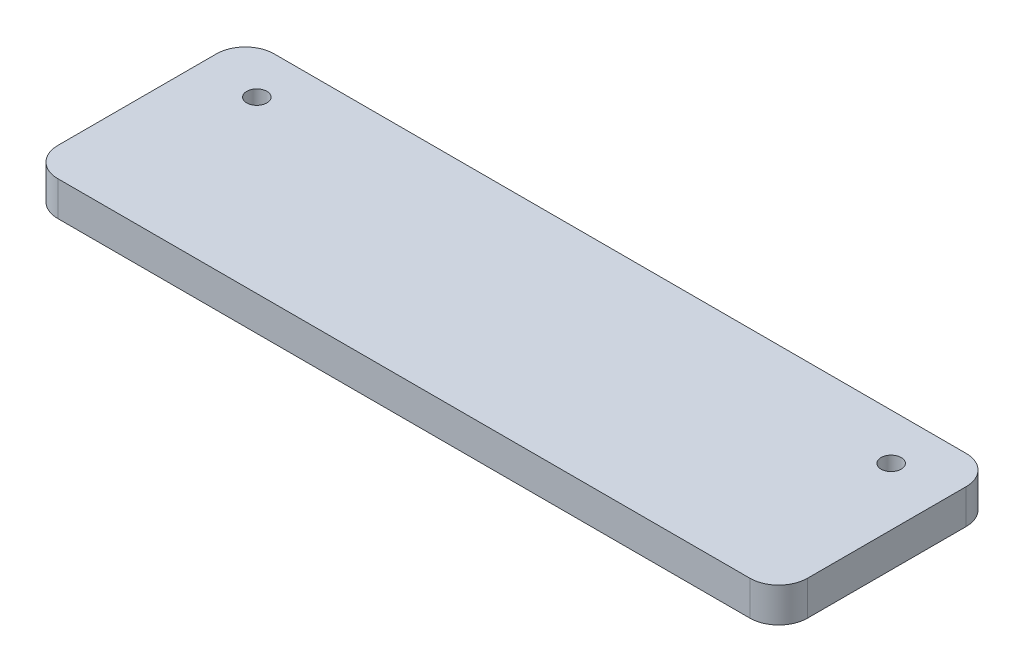
ISO-10303-21;
HEADER;
FILE_DESCRIPTION(('STEP AP214'),'2;1');
FILE_NAME('part.step','',(''),(''),'','','');
FILE_SCHEMA(('AUTOMOTIVE_DESIGN { 1 0 10303 214 1 1 1 1 }'));
ENDSEC;
DATA;
#1=APPLICATION_CONTEXT('core data for automotive mechanical design processes');
#2=APPLICATION_PROTOCOL_DEFINITION('international standard','automotive_design',2000,#1);
#3=PRODUCT_CONTEXT('',#1,'mechanical');
#4=PRODUCT('Part','Part','',(#3));
#5=PRODUCT_RELATED_PRODUCT_CATEGORY('part','',(#4));
#6=PRODUCT_DEFINITION_FORMATION('','',#4);
#7=PRODUCT_DEFINITION_CONTEXT('part definition',#1,'design');
#8=PRODUCT_DEFINITION('design','',#6,#7);
#9=PRODUCT_DEFINITION_SHAPE('','',#8);
#10=(LENGTH_UNIT() NAMED_UNIT(*) SI_UNIT(.MILLI.,.METRE.));
#11=(NAMED_UNIT(*) PLANE_ANGLE_UNIT() SI_UNIT($,.RADIAN.));
#12=(NAMED_UNIT(*) SI_UNIT($,.STERADIAN.) SOLID_ANGLE_UNIT());
#13=UNCERTAINTY_MEASURE_WITH_UNIT(LENGTH_MEASURE(1.E-05),#10,'distance_accuracy_value','');
#14=(GEOMETRIC_REPRESENTATION_CONTEXT(3) GLOBAL_UNCERTAINTY_ASSIGNED_CONTEXT((#13)) GLOBAL_UNIT_ASSIGNED_CONTEXT((#10,
#11,#12)) REPRESENTATION_CONTEXT('',''));
#15=CARTESIAN_POINT('',(0.,0.,0.));
#16=DIRECTION('',(0.,0.,1.));
#17=DIRECTION('',(1.,0.,0.));
#18=AXIS2_PLACEMENT_3D('',#15,#16,#17);
#19=CARTESIAN_POINT('',(0.,6.,0.));
#20=DIRECTION('',(1.,0.,0.));
#21=DIRECTION('',(0.,0.,-1.));
#22=AXIS2_PLACEMENT_3D('',#19,#20,#21);
#23=PLANE('',#22);
#24=DIRECTION('',(0.,0.,1.));
#25=VECTOR('',#24,1.);
#26=CARTESIAN_POINT('',(0.,6.,0.));
#27=LINE('',#26,#25);
#28=CARTESIAN_POINT('',(0.,6.,-32.5));
#29=VERTEX_POINT('',#28);
#30=CARTESIAN_POINT('',(0.,6.,-5.));
#31=VERTEX_POINT('',#30);
#32=EDGE_CURVE('E126',#29,#31,#27,.T.);
#33=ORIENTED_EDGE('',*,*,#32,.F.);
#34=DIRECTION('',(0.,-1.,0.));
#35=VECTOR('',#34,1.);
#36=CARTESIAN_POINT('',(0.,6.,-32.5));
#37=LINE('',#36,#35);
#38=CARTESIAN_POINT('',(0.,0.,-32.5));
#39=VERTEX_POINT('',#38);
#40=EDGE_CURVE('E110',#29,#39,#37,.T.);
#41=ORIENTED_EDGE('',*,*,#40,.T.);
#42=DIRECTION('',(0.,0.,1.));
#43=VECTOR('',#42,1.);
#44=CARTESIAN_POINT('',(0.,0.,0.));
#45=LINE('',#44,#43);
#46=CARTESIAN_POINT('',(0.,0.,-5.));
#47=VERTEX_POINT('',#46);
#48=EDGE_CURVE('E123',#39,#47,#45,.T.);
#49=ORIENTED_EDGE('',*,*,#48,.T.);
#50=DIRECTION('',(0.,-1.,0.));
#51=VECTOR('',#50,1.);
#52=CARTESIAN_POINT('',(0.,6.,-5.));
#53=LINE('',#52,#51);
#54=EDGE_CURVE('E129',#47,#31,#53,.F.);
#55=ORIENTED_EDGE('',*,*,#54,.T.);
#56=EDGE_LOOP('',(#33,#41,#49,#55));
#57=FACE_BOUND('',#56,.T.);
#58=ADVANCED_FACE('F39',(#57),#23,.F.);
#59=CARTESIAN_POINT('',(0.,6.,0.));
#60=DIRECTION('',(0.,0.,-1.));
#61=DIRECTION('',(-1.,0.,0.));
#62=AXIS2_PLACEMENT_3D('',#59,#60,#61);
#63=PLANE('',#62);
#64=DIRECTION('',(1.,0.,0.));
#65=VECTOR('',#64,1.);
#66=CARTESIAN_POINT('',(0.,0.,0.));
#67=LINE('',#66,#65);
#68=CARTESIAN_POINT('',(5.,0.,0.));
#69=VERTEX_POINT('',#68);
#70=CARTESIAN_POINT('',(125.,0.,0.));
#71=VERTEX_POINT('',#70);
#72=EDGE_CURVE('E134',#69,#71,#67,.T.);
#73=ORIENTED_EDGE('',*,*,#72,.T.);
#74=DIRECTION('',(0.,-1.,0.));
#75=VECTOR('',#74,1.);
#76=CARTESIAN_POINT('',(125.,6.,0.));
#77=LINE('',#76,#75);
#78=CARTESIAN_POINT('',(125.,6.,0.));
#79=VERTEX_POINT('',#78);
#80=EDGE_CURVE('E11',#71,#79,#77,.F.);
#81=ORIENTED_EDGE('',*,*,#80,.T.);
#82=DIRECTION('',(1.,0.,0.));
#83=VECTOR('',#82,1.);
#84=CARTESIAN_POINT('',(0.,6.,0.));
#85=LINE('',#84,#83);
#86=CARTESIAN_POINT('',(5.,6.,0.));
#87=VERTEX_POINT('',#86);
#88=EDGE_CURVE('E191',#87,#79,#85,.T.);
#89=ORIENTED_EDGE('',*,*,#88,.F.);
#90=DIRECTION('',(0.,-1.,0.));
#91=VECTOR('',#90,1.);
#92=CARTESIAN_POINT('',(5.,6.,0.));
#93=LINE('',#92,#91);
#94=EDGE_CURVE('E48',#87,#69,#93,.T.);
#95=ORIENTED_EDGE('',*,*,#94,.T.);
#96=EDGE_LOOP('',(#73,#81,#89,#95));
#97=FACE_BOUND('',#96,.T.);
#98=ADVANCED_FACE('F189',(#97),#63,.F.);
#99=CARTESIAN_POINT('',(130.,6.,0.));
#100=DIRECTION('',(-1.,0.,0.));
#101=DIRECTION('',(0.,0.,1.));
#102=AXIS2_PLACEMENT_3D('',#99,#100,#101);
#103=PLANE('',#102);
#104=DIRECTION('',(0.,0.,-1.));
#105=VECTOR('',#104,1.);
#106=CARTESIAN_POINT('',(130.,0.,0.));
#107=LINE('',#106,#105);
#108=CARTESIAN_POINT('',(130.,0.,-5.));
#109=VERTEX_POINT('',#108);
#110=CARTESIAN_POINT('',(130.,0.,-32.5));
#111=VERTEX_POINT('',#110);
#112=EDGE_CURVE('E140',#109,#111,#107,.T.);
#113=ORIENTED_EDGE('',*,*,#112,.T.);
#114=DIRECTION('',(0.,-1.,0.));
#115=VECTOR('',#114,1.);
#116=CARTESIAN_POINT('',(130.,6.,-32.5));
#117=LINE('',#116,#115);
#118=CARTESIAN_POINT('',(130.,6.,-32.5));
#119=VERTEX_POINT('',#118);
#120=EDGE_CURVE('E55',#111,#119,#117,.F.);
#121=ORIENTED_EDGE('',*,*,#120,.T.);
#122=DIRECTION('',(0.,0.,-1.));
#123=VECTOR('',#122,1.);
#124=CARTESIAN_POINT('',(130.,6.,0.));
#125=LINE('',#124,#123);
#126=CARTESIAN_POINT('',(130.,6.,-5.));
#127=VERTEX_POINT('',#126);
#128=EDGE_CURVE('E199',#127,#119,#125,.T.);
#129=ORIENTED_EDGE('',*,*,#128,.F.);
#130=DIRECTION('',(0.,-1.,0.));
#131=VECTOR('',#130,1.);
#132=CARTESIAN_POINT('',(130.,6.,-5.));
#133=LINE('',#132,#131);
#134=EDGE_CURVE('E179',#127,#109,#133,.T.);
#135=ORIENTED_EDGE('',*,*,#134,.T.);
#136=EDGE_LOOP('',(#113,#121,#129,#135));
#137=FACE_BOUND('',#136,.T.);
#138=ADVANCED_FACE('F198',(#137),#103,.F.);
#139=CARTESIAN_POINT('',(0.,6.,-37.5));
#140=DIRECTION('',(0.,0.,1.));
#141=DIRECTION('',(1.,0.,0.));
#142=AXIS2_PLACEMENT_3D('',#139,#140,#141);
#143=PLANE('',#142);
#144=DIRECTION('',(-1.,0.,0.));
#145=VECTOR('',#144,1.);
#146=CARTESIAN_POINT('',(0.,0.,-37.5));
#147=LINE('',#146,#145);
#148=CARTESIAN_POINT('',(125.,0.,-37.5));
#149=VERTEX_POINT('',#148);
#150=CARTESIAN_POINT('',(5.,0.,-37.5));
#151=VERTEX_POINT('',#150);
#152=EDGE_CURVE('E151',#149,#151,#147,.T.);
#153=ORIENTED_EDGE('',*,*,#152,.T.);
#154=DIRECTION('',(0.,-1.,0.));
#155=VECTOR('',#154,1.);
#156=CARTESIAN_POINT('',(5.,6.,-37.5));
#157=LINE('',#156,#155);
#158=CARTESIAN_POINT('',(5.,6.,-37.5));
#159=VERTEX_POINT('',#158);
#160=EDGE_CURVE('E111',#151,#159,#157,.F.);
#161=ORIENTED_EDGE('',*,*,#160,.T.);
#162=DIRECTION('',(-1.,0.,0.));
#163=VECTOR('',#162,1.);
#164=CARTESIAN_POINT('',(0.,6.,-37.5));
#165=LINE('',#164,#163);
#166=CARTESIAN_POINT('',(125.,6.,-37.5));
#167=VERTEX_POINT('',#166);
#168=EDGE_CURVE('E146',#167,#159,#165,.T.);
#169=ORIENTED_EDGE('',*,*,#168,.F.);
#170=DIRECTION('',(0.,-1.,0.));
#171=VECTOR('',#170,1.);
#172=CARTESIAN_POINT('',(125.,6.,-37.5));
#173=LINE('',#172,#171);
#174=EDGE_CURVE('E117',#167,#149,#173,.T.);
#175=ORIENTED_EDGE('',*,*,#174,.T.);
#176=EDGE_LOOP('',(#153,#161,#169,#175));
#177=FACE_BOUND('',#176,.T.);
#178=ADVANCED_FACE('F226',(#177),#143,.F.);
#179=CARTESIAN_POINT('',(0.,6.,0.));
#180=DIRECTION('',(0.,-1.,0.));
#181=DIRECTION('',(0.,0.,-1.));
#182=AXIS2_PLACEMENT_3D('',#179,#180,#181);
#183=PLANE('',#182);
#184=CARTESIAN_POINT('',(10.,6.,-29.5));
#185=DIRECTION('',(0.,1.,0.));
#186=DIRECTION('',(0.,0.,1.));
#187=AXIS2_PLACEMENT_3D('',#184,#185,#186);
#188=CIRCLE('',#187,1.75);
#189=CARTESIAN_POINT('',(10.,6.,-27.75));
#190=VERTEX_POINT('',#189);
#191=EDGE_CURVE('E143',#190,#190,#188,.T.);
#192=ORIENTED_EDGE('',*,*,#191,.F.);
#193=EDGE_LOOP('',(#192));
#194=FACE_BOUND('',#193,.T.);
#195=CARTESIAN_POINT('',(120.,6.,-29.5));
#196=DIRECTION('',(0.,1.,0.));
#197=DIRECTION('',(0.,0.,1.));
#198=AXIS2_PLACEMENT_3D('',#195,#196,#197);
#199=CIRCLE('',#198,1.75000000000001);
#200=CARTESIAN_POINT('',(120.,6.,-27.75));
#201=VERTEX_POINT('',#200);
#202=EDGE_CURVE('E209',#201,#201,#199,.T.);
#203=ORIENTED_EDGE('',*,*,#202,.F.);
#204=EDGE_LOOP('',(#203));
#205=FACE_BOUND('',#204,.T.);
#206=ORIENTED_EDGE('',*,*,#168,.T.);
#207=CARTESIAN_POINT('',(5.,6.,-32.5));
#208=DIRECTION('',(0.,-1.,0.));
#209=DIRECTION('',(0.,0.,-1.));
#210=AXIS2_PLACEMENT_3D('',#207,#208,#209);
#211=CIRCLE('',#210,5.);
#212=EDGE_CURVE('E176',#159,#29,#211,.F.);
#213=ORIENTED_EDGE('',*,*,#212,.T.);
#214=ORIENTED_EDGE('',*,*,#32,.T.);
#215=CARTESIAN_POINT('',(5.,6.,-5.));
#216=DIRECTION('',(0.,-1.,0.));
#217=DIRECTION('',(0.,0.,-1.));
#218=AXIS2_PLACEMENT_3D('',#215,#216,#217);
#219=CIRCLE('',#218,5.);
#220=EDGE_CURVE('E168',#31,#87,#219,.F.);
#221=ORIENTED_EDGE('',*,*,#220,.T.);
#222=ORIENTED_EDGE('',*,*,#88,.T.);
#223=CARTESIAN_POINT('',(125.,6.,-5.));
#224=DIRECTION('',(0.,-1.,0.));
#225=DIRECTION('',(0.,0.,-1.));
#226=AXIS2_PLACEMENT_3D('',#223,#224,#225);
#227=CIRCLE('',#226,5.);
#228=EDGE_CURVE('E62',#79,#127,#227,.F.);
#229=ORIENTED_EDGE('',*,*,#228,.T.);
#230=ORIENTED_EDGE('',*,*,#128,.T.);
#231=CARTESIAN_POINT('',(125.,6.,-32.5));
#232=DIRECTION('',(0.,-1.,0.));
#233=DIRECTION('',(0.,0.,-1.));
#234=AXIS2_PLACEMENT_3D('',#231,#232,#233);
#235=CIRCLE('',#234,5.);
#236=EDGE_CURVE('E173',#119,#167,#235,.F.);
#237=ORIENTED_EDGE('',*,*,#236,.T.);
#238=EDGE_LOOP('',(#206,#213,#214,#221,#222,#229,#230,#237));
#239=FACE_BOUND('',#238,.T.);
#240=ADVANCED_FACE('F223',(#194,#205,#239),#183,.F.);
#241=CARTESIAN_POINT('',(0.,0.,0.));
#242=DIRECTION('',(0.,-1.,0.));
#243=DIRECTION('',(0.,0.,-1.));
#244=AXIS2_PLACEMENT_3D('',#241,#242,#243);
#245=PLANE('',#244);
#246=CARTESIAN_POINT('',(10.,0.,-29.5));
#247=DIRECTION('',(0.,1.,0.));
#248=DIRECTION('',(0.,0.,1.));
#249=AXIS2_PLACEMENT_3D('',#246,#247,#248);
#250=CIRCLE('',#249,1.75);
#251=CARTESIAN_POINT('',(10.,0.,-27.75));
#252=VERTEX_POINT('',#251);
#253=EDGE_CURVE('E135',#252,#252,#250,.T.);
#254=ORIENTED_EDGE('',*,*,#253,.T.);
#255=EDGE_LOOP('',(#254));
#256=FACE_BOUND('',#255,.T.);
#257=CARTESIAN_POINT('',(120.,0.,-29.5));
#258=DIRECTION('',(0.,1.,0.));
#259=DIRECTION('',(0.,0.,1.));
#260=AXIS2_PLACEMENT_3D('',#257,#258,#259);
#261=CIRCLE('',#260,1.75000000000001);
#262=CARTESIAN_POINT('',(120.,0.,-27.75));
#263=VERTEX_POINT('',#262);
#264=EDGE_CURVE('E213',#263,#263,#261,.T.);
#265=ORIENTED_EDGE('',*,*,#264,.T.);
#266=EDGE_LOOP('',(#265));
#267=FACE_BOUND('',#266,.T.);
#268=ORIENTED_EDGE('',*,*,#48,.F.);
#269=CARTESIAN_POINT('',(5.,0.,-32.5));
#270=DIRECTION('',(0.,-1.,0.));
#271=DIRECTION('',(0.,0.,-1.));
#272=AXIS2_PLACEMENT_3D('',#269,#270,#271);
#273=CIRCLE('',#272,5.);
#274=EDGE_CURVE('E106',#39,#151,#273,.T.);
#275=ORIENTED_EDGE('',*,*,#274,.T.);
#276=ORIENTED_EDGE('',*,*,#152,.F.);
#277=CARTESIAN_POINT('',(125.,0.,-32.5));
#278=DIRECTION('',(0.,-1.,0.));
#279=DIRECTION('',(0.,0.,-1.));
#280=AXIS2_PLACEMENT_3D('',#277,#278,#279);
#281=CIRCLE('',#280,5.);
#282=EDGE_CURVE('E118',#149,#111,#281,.T.);
#283=ORIENTED_EDGE('',*,*,#282,.T.);
#284=ORIENTED_EDGE('',*,*,#112,.F.);
#285=CARTESIAN_POINT('',(125.,0.,-5.));
#286=DIRECTION('',(0.,-1.,0.));
#287=DIRECTION('',(0.,0.,-1.));
#288=AXIS2_PLACEMENT_3D('',#285,#286,#287);
#289=CIRCLE('',#288,5.);
#290=EDGE_CURVE('E158',#109,#71,#289,.T.);
#291=ORIENTED_EDGE('',*,*,#290,.T.);
#292=ORIENTED_EDGE('',*,*,#72,.F.);
#293=CARTESIAN_POINT('',(5.,0.,-5.));
#294=DIRECTION('',(0.,-1.,0.));
#295=DIRECTION('',(0.,0.,-1.));
#296=AXIS2_PLACEMENT_3D('',#293,#294,#295);
#297=CIRCLE('',#296,5.);
#298=EDGE_CURVE('E128',#69,#47,#297,.T.);
#299=ORIENTED_EDGE('',*,*,#298,.T.);
#300=EDGE_LOOP('',(#268,#275,#276,#283,#284,#291,#292,#299));
#301=FACE_BOUND('',#300,.T.);
#302=ADVANCED_FACE('F131',(#256,#267,#301),#245,.T.);
#303=CARTESIAN_POINT('',(5.,6.,-32.5));
#304=DIRECTION('',(0.,-1.,0.));
#305=DIRECTION('',(0.,0.,-1.));
#306=AXIS2_PLACEMENT_3D('',#303,#304,#305);
#307=CYLINDRICAL_SURFACE('',#306,5.);
#308=ORIENTED_EDGE('',*,*,#212,.F.);
#309=ORIENTED_EDGE('',*,*,#160,.F.);
#310=ORIENTED_EDGE('',*,*,#274,.F.);
#311=ORIENTED_EDGE('',*,*,#40,.F.);
#312=EDGE_LOOP('',(#308,#309,#310,#311));
#313=FACE_BOUND('',#312,.T.);
#314=ADVANCED_FACE('F109',(#313),#307,.T.);
#315=CARTESIAN_POINT('',(125.,6.,-32.5));
#316=DIRECTION('',(0.,-1.,0.));
#317=DIRECTION('',(0.,0.,-1.));
#318=AXIS2_PLACEMENT_3D('',#315,#316,#317);
#319=CYLINDRICAL_SURFACE('',#318,5.);
#320=ORIENTED_EDGE('',*,*,#236,.F.);
#321=ORIENTED_EDGE('',*,*,#120,.F.);
#322=ORIENTED_EDGE('',*,*,#282,.F.);
#323=ORIENTED_EDGE('',*,*,#174,.F.);
#324=EDGE_LOOP('',(#320,#321,#322,#323));
#325=FACE_BOUND('',#324,.T.);
#326=ADVANCED_FACE('F233',(#325),#319,.T.);
#327=CARTESIAN_POINT('',(125.,6.,-5.));
#328=DIRECTION('',(0.,-1.,0.));
#329=DIRECTION('',(0.,0.,-1.));
#330=AXIS2_PLACEMENT_3D('',#327,#328,#329);
#331=CYLINDRICAL_SURFACE('',#330,5.);
#332=ORIENTED_EDGE('',*,*,#228,.F.);
#333=ORIENTED_EDGE('',*,*,#80,.F.);
#334=ORIENTED_EDGE('',*,*,#290,.F.);
#335=ORIENTED_EDGE('',*,*,#134,.F.);
#336=EDGE_LOOP('',(#332,#333,#334,#335));
#337=FACE_BOUND('',#336,.T.);
#338=ADVANCED_FACE('F197',(#337),#331,.T.);
#339=CARTESIAN_POINT('',(5.,6.,-5.));
#340=DIRECTION('',(0.,-1.,0.));
#341=DIRECTION('',(0.,0.,-1.));
#342=AXIS2_PLACEMENT_3D('',#339,#340,#341);
#343=CYLINDRICAL_SURFACE('',#342,5.);
#344=ORIENTED_EDGE('',*,*,#220,.F.);
#345=ORIENTED_EDGE('',*,*,#54,.F.);
#346=ORIENTED_EDGE('',*,*,#298,.F.);
#347=ORIENTED_EDGE('',*,*,#94,.F.);
#348=EDGE_LOOP('',(#344,#345,#346,#347));
#349=FACE_BOUND('',#348,.T.);
#350=ADVANCED_FACE('F41',(#349),#343,.T.);
#351=CARTESIAN_POINT('',(120.,0.,-29.5));
#352=DIRECTION('',(0.,1.,0.));
#353=DIRECTION('',(0.,0.,1.));
#354=AXIS2_PLACEMENT_3D('',#351,#352,#353);
#355=CYLINDRICAL_SURFACE('',#354,1.75000000000001);
#356=ORIENTED_EDGE('',*,*,#264,.F.);
#357=EDGE_LOOP('',(#356));
#358=FACE_BOUND('',#357,.T.);
#359=ORIENTED_EDGE('',*,*,#202,.T.);
#360=EDGE_LOOP('',(#359));
#361=FACE_BOUND('',#360,.T.);
#362=ADVANCED_FACE('F255',(#358,#361),#355,.F.);
#363=CARTESIAN_POINT('',(10.,0.,-29.5));
#364=DIRECTION('',(0.,1.,0.));
#365=DIRECTION('',(0.,0.,1.));
#366=AXIS2_PLACEMENT_3D('',#363,#364,#365);
#367=CYLINDRICAL_SURFACE('',#366,1.75);
#368=ORIENTED_EDGE('',*,*,#253,.F.);
#369=EDGE_LOOP('',(#368));
#370=FACE_BOUND('',#369,.T.);
#371=ORIENTED_EDGE('',*,*,#191,.T.);
#372=EDGE_LOOP('',(#371));
#373=FACE_BOUND('',#372,.T.);
#374=ADVANCED_FACE('F221',(#370,#373),#367,.F.);
#375=CLOSED_SHELL('',(#58,#98,#138,#178,#240,#302,#314,#326,#338,#350,#362,#374));
#376=MANIFOLD_SOLID_BREP('B2',#375);
#377=ADVANCED_BREP_SHAPE_REPRESENTATION('',(#18,#376),#14);
#378=SHAPE_DEFINITION_REPRESENTATION(#9,#377);
ENDSEC;
END-ISO-10303-21;
